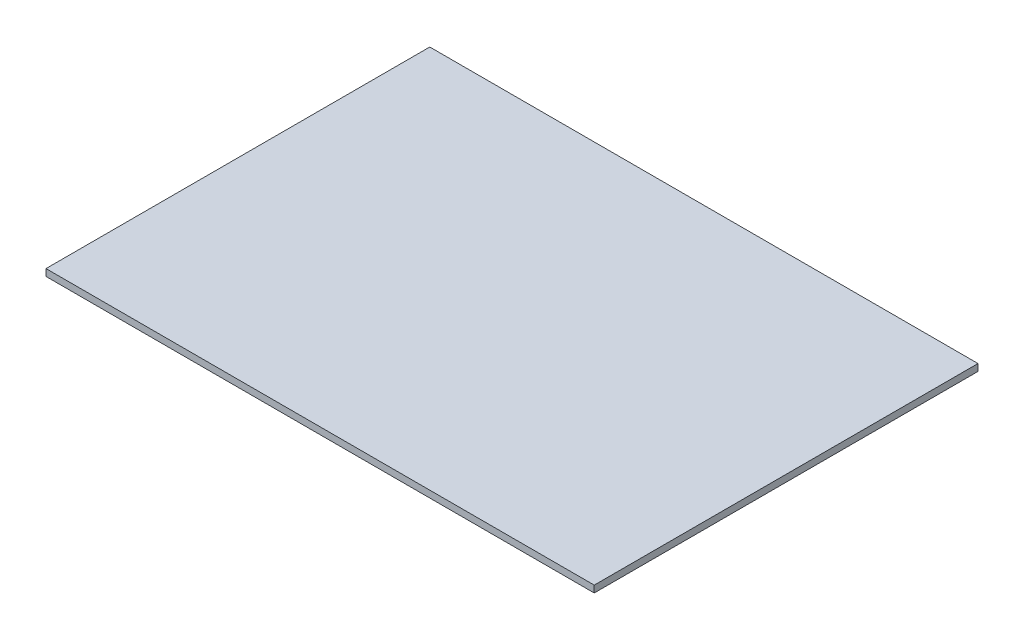
ISO-10303-21;
HEADER;
FILE_DESCRIPTION(('STEP AP214'),'2;1');
FILE_NAME('part.step','',(''),(''),'','','');
FILE_SCHEMA(('AUTOMOTIVE_DESIGN { 1 0 10303 214 1 1 1 1 }'));
ENDSEC;
DATA;
#1=APPLICATION_CONTEXT('core data for automotive mechanical design processes');
#2=APPLICATION_PROTOCOL_DEFINITION('international standard','automotive_design',2000,#1);
#3=PRODUCT_CONTEXT('',#1,'mechanical');
#4=PRODUCT('Part','Part','',(#3));
#5=PRODUCT_RELATED_PRODUCT_CATEGORY('part','',(#4));
#6=PRODUCT_DEFINITION_FORMATION('','',#4);
#7=PRODUCT_DEFINITION_CONTEXT('part definition',#1,'design');
#8=PRODUCT_DEFINITION('design','',#6,#7);
#9=PRODUCT_DEFINITION_SHAPE('','',#8);
#10=(LENGTH_UNIT() NAMED_UNIT(*) SI_UNIT(.MILLI.,.METRE.));
#11=(NAMED_UNIT(*) PLANE_ANGLE_UNIT() SI_UNIT($,.RADIAN.));
#12=(NAMED_UNIT(*) SI_UNIT($,.STERADIAN.) SOLID_ANGLE_UNIT());
#13=UNCERTAINTY_MEASURE_WITH_UNIT(LENGTH_MEASURE(1.E-05),#10,'distance_accuracy_value','');
#14=(GEOMETRIC_REPRESENTATION_CONTEXT(3) GLOBAL_UNCERTAINTY_ASSIGNED_CONTEXT((#13)) GLOBAL_UNIT_ASSIGNED_CONTEXT((#10,
#11,#12)) REPRESENTATION_CONTEXT('',''));
#15=CARTESIAN_POINT('',(0.,0.,0.));
#16=DIRECTION('',(0.,0.,1.));
#17=DIRECTION('',(1.,0.,0.));
#18=AXIS2_PLACEMENT_3D('',#15,#16,#17);
#19=CARTESIAN_POINT('',(63.5,-0.79375,44.45));
#20=DIRECTION('',(0.,1.,0.));
#21=DIRECTION('',(0.,0.,1.));
#22=AXIS2_PLACEMENT_3D('',#19,#20,#21);
#23=PLANE('',#22);
#24=DIRECTION('',(-1.,0.,0.));
#25=VECTOR('',#24,1.);
#26=CARTESIAN_POINT('',(-63.5,-0.79375,44.45));
#27=LINE('',#26,#25);
#28=CARTESIAN_POINT('',(63.5,-0.79375,44.45));
#29=VERTEX_POINT('',#28);
#30=CARTESIAN_POINT('',(-63.5,-0.79375,44.45));
#31=VERTEX_POINT('',#30);
#32=EDGE_CURVE('E81',#29,#31,#27,.T.);
#33=ORIENTED_EDGE('',*,*,#32,.T.);
#34=DIRECTION('',(0.,0.,-1.));
#35=VECTOR('',#34,1.);
#36=CARTESIAN_POINT('',(-63.5,-0.79375,-44.45));
#37=LINE('',#36,#35);
#38=CARTESIAN_POINT('',(-63.5,-0.79375,-44.45));
#39=VERTEX_POINT('',#38);
#40=EDGE_CURVE('E68',#31,#39,#37,.T.);
#41=ORIENTED_EDGE('',*,*,#40,.T.);
#42=DIRECTION('',(1.,0.,0.));
#43=VECTOR('',#42,1.);
#44=CARTESIAN_POINT('',(-63.5,-0.79375,-44.45));
#45=LINE('',#44,#43);
#46=CARTESIAN_POINT('',(63.5,-0.79375,-44.45));
#47=VERTEX_POINT('',#46);
#48=EDGE_CURVE('E55',#39,#47,#45,.T.);
#49=ORIENTED_EDGE('',*,*,#48,.T.);
#50=DIRECTION('',(0.,0.,1.));
#51=VECTOR('',#50,1.);
#52=CARTESIAN_POINT('',(63.5,-0.79375,-44.45));
#53=LINE('',#52,#51);
#54=EDGE_CURVE('E20',#47,#29,#53,.T.);
#55=ORIENTED_EDGE('',*,*,#54,.T.);
#56=EDGE_LOOP('',(#33,#41,#49,#55));
#57=FACE_BOUND('',#56,.T.);
#58=ADVANCED_FACE('F17',(#57),#23,.F.);
#59=CARTESIAN_POINT('',(63.5,0.79375,-44.45));
#60=DIRECTION('',(-1.,0.,0.));
#61=DIRECTION('',(0.,0.,1.));
#62=AXIS2_PLACEMENT_3D('',#59,#60,#61);
#63=PLANE('',#62);
#64=DIRECTION('',(0.,1.,0.));
#65=VECTOR('',#64,1.);
#66=CARTESIAN_POINT('',(63.5,0.79375,-44.45));
#67=LINE('',#66,#65);
#68=CARTESIAN_POINT('',(63.5,0.79375,-44.45));
#69=VERTEX_POINT('',#68);
#70=EDGE_CURVE('E61',#47,#69,#67,.T.);
#71=ORIENTED_EDGE('',*,*,#70,.T.);
#72=DIRECTION('',(0.,0.,1.));
#73=VECTOR('',#72,1.);
#74=CARTESIAN_POINT('',(63.5,0.79375,44.45));
#75=LINE('',#74,#73);
#76=CARTESIAN_POINT('',(63.5,0.79375,44.45));
#77=VERTEX_POINT('',#76);
#78=EDGE_CURVE('E83',#77,#69,#75,.F.);
#79=ORIENTED_EDGE('',*,*,#78,.F.);
#80=DIRECTION('',(0.,1.,0.));
#81=VECTOR('',#80,1.);
#82=CARTESIAN_POINT('',(63.5,0.79375,44.45));
#83=LINE('',#82,#81);
#84=EDGE_CURVE('E64',#77,#29,#83,.F.);
#85=ORIENTED_EDGE('',*,*,#84,.T.);
#86=ORIENTED_EDGE('',*,*,#54,.F.);
#87=EDGE_LOOP('',(#71,#79,#85,#86));
#88=FACE_BOUND('',#87,.T.);
#89=ADVANCED_FACE('F60',(#88),#63,.F.);
#90=CARTESIAN_POINT('',(-63.5,0.79375,-44.45));
#91=DIRECTION('',(0.,0.,1.));
#92=DIRECTION('',(1.,0.,0.));
#93=AXIS2_PLACEMENT_3D('',#90,#91,#92);
#94=PLANE('',#93);
#95=DIRECTION('',(0.,1.,0.));
#96=VECTOR('',#95,1.);
#97=CARTESIAN_POINT('',(-63.5,0.79375,-44.45));
#98=LINE('',#97,#96);
#99=CARTESIAN_POINT('',(-63.5,0.79375,-44.45));
#100=VERTEX_POINT('',#99);
#101=EDGE_CURVE('E70',#39,#100,#98,.T.);
#102=ORIENTED_EDGE('',*,*,#101,.T.);
#103=DIRECTION('',(1.,0.,0.));
#104=VECTOR('',#103,1.);
#105=CARTESIAN_POINT('',(63.5,0.79375,-44.45));
#106=LINE('',#105,#104);
#107=EDGE_CURVE('E74',#69,#100,#106,.F.);
#108=ORIENTED_EDGE('',*,*,#107,.F.);
#109=ORIENTED_EDGE('',*,*,#70,.F.);
#110=ORIENTED_EDGE('',*,*,#48,.F.);
#111=EDGE_LOOP('',(#102,#108,#109,#110));
#112=FACE_BOUND('',#111,.T.);
#113=ADVANCED_FACE('F72',(#112),#94,.F.);
#114=CARTESIAN_POINT('',(-63.5,0.79375,-44.45));
#115=DIRECTION('',(1.,0.,0.));
#116=DIRECTION('',(0.,0.,-1.));
#117=AXIS2_PLACEMENT_3D('',#114,#115,#116);
#118=PLANE('',#117);
#119=DIRECTION('',(0.,1.,0.));
#120=VECTOR('',#119,1.);
#121=CARTESIAN_POINT('',(-63.5,0.79375,44.45));
#122=LINE('',#121,#120);
#123=CARTESIAN_POINT('',(-63.5,0.79375,44.45));
#124=VERTEX_POINT('',#123);
#125=EDGE_CURVE('E35',#31,#124,#122,.T.);
#126=ORIENTED_EDGE('',*,*,#125,.T.);
#127=DIRECTION('',(0.,0.,1.));
#128=VECTOR('',#127,1.);
#129=CARTESIAN_POINT('',(-63.5,0.79375,44.45));
#130=LINE('',#129,#128);
#131=EDGE_CURVE('E26',#100,#124,#130,.T.);
#132=ORIENTED_EDGE('',*,*,#131,.F.);
#133=ORIENTED_EDGE('',*,*,#101,.F.);
#134=ORIENTED_EDGE('',*,*,#40,.F.);
#135=EDGE_LOOP('',(#126,#132,#133,#134));
#136=FACE_BOUND('',#135,.T.);
#137=ADVANCED_FACE('F89',(#136),#118,.F.);
#138=CARTESIAN_POINT('',(-63.5,0.79375,44.45));
#139=DIRECTION('',(0.,0.,-1.));
#140=DIRECTION('',(-1.,0.,0.));
#141=AXIS2_PLACEMENT_3D('',#138,#139,#140);
#142=PLANE('',#141);
#143=ORIENTED_EDGE('',*,*,#84,.F.);
#144=DIRECTION('',(1.,0.,0.));
#145=VECTOR('',#144,1.);
#146=CARTESIAN_POINT('',(63.5,0.79375,44.45));
#147=LINE('',#146,#145);
#148=EDGE_CURVE('E11',#124,#77,#147,.T.);
#149=ORIENTED_EDGE('',*,*,#148,.F.);
#150=ORIENTED_EDGE('',*,*,#125,.F.);
#151=ORIENTED_EDGE('',*,*,#32,.F.);
#152=EDGE_LOOP('',(#143,#149,#150,#151));
#153=FACE_BOUND('',#152,.T.);
#154=ADVANCED_FACE('F91',(#153),#142,.F.);
#155=CARTESIAN_POINT('',(63.5,0.79375,44.45));
#156=DIRECTION('',(0.,1.,0.));
#157=DIRECTION('',(0.,0.,1.));
#158=AXIS2_PLACEMENT_3D('',#155,#156,#157);
#159=PLANE('',#158);
#160=ORIENTED_EDGE('',*,*,#131,.T.);
#161=ORIENTED_EDGE('',*,*,#148,.T.);
#162=ORIENTED_EDGE('',*,*,#78,.T.);
#163=ORIENTED_EDGE('',*,*,#107,.T.);
#164=EDGE_LOOP('',(#160,#161,#162,#163));
#165=FACE_BOUND('',#164,.T.);
#166=ADVANCED_FACE('F88',(#165),#159,.T.);
#167=CLOSED_SHELL('',(#58,#89,#113,#137,#154,#166));
#168=MANIFOLD_SOLID_BREP('B1',#167);
#169=ADVANCED_BREP_SHAPE_REPRESENTATION('',(#18,#168),#14);
#170=SHAPE_DEFINITION_REPRESENTATION(#9,#169);
ENDSEC;
END-ISO-10303-21;
